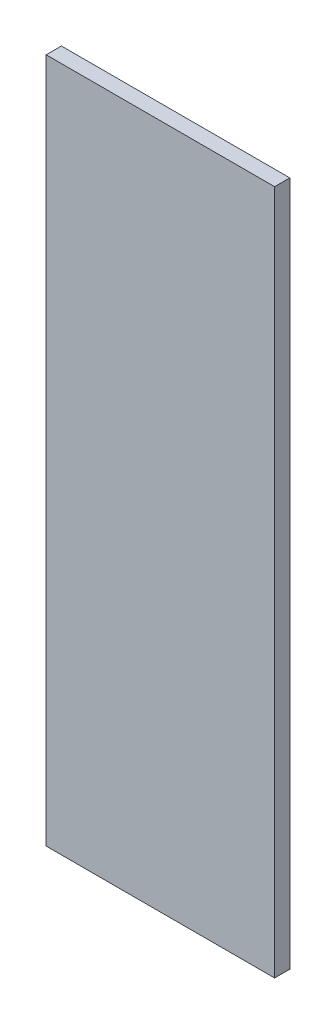
ISO-10303-21;
HEADER;
FILE_DESCRIPTION(('STEP AP214'),'2;1');
FILE_NAME('part.step','',(''),(''),'','','');
FILE_SCHEMA(('AUTOMOTIVE_DESIGN { 1 0 10303 214 1 1 1 1 }'));
ENDSEC;
DATA;
#1=APPLICATION_CONTEXT('core data for automotive mechanical design processes');
#2=APPLICATION_PROTOCOL_DEFINITION('international standard','automotive_design',2000,#1);
#3=PRODUCT_CONTEXT('',#1,'mechanical');
#4=PRODUCT('Part','Part','',(#3));
#5=PRODUCT_RELATED_PRODUCT_CATEGORY('part','',(#4));
#6=PRODUCT_DEFINITION_FORMATION('','',#4);
#7=PRODUCT_DEFINITION_CONTEXT('part definition',#1,'design');
#8=PRODUCT_DEFINITION('design','',#6,#7);
#9=PRODUCT_DEFINITION_SHAPE('','',#8);
#10=(LENGTH_UNIT() NAMED_UNIT(*) SI_UNIT(.MILLI.,.METRE.));
#11=(NAMED_UNIT(*) PLANE_ANGLE_UNIT() SI_UNIT($,.RADIAN.));
#12=(NAMED_UNIT(*) SI_UNIT($,.STERADIAN.) SOLID_ANGLE_UNIT());
#13=UNCERTAINTY_MEASURE_WITH_UNIT(LENGTH_MEASURE(1.E-05),#10,'distance_accuracy_value','');
#14=(GEOMETRIC_REPRESENTATION_CONTEXT(3) GLOBAL_UNCERTAINTY_ASSIGNED_CONTEXT((#13)) GLOBAL_UNIT_ASSIGNED_CONTEXT((#10,
#11,#12)) REPRESENTATION_CONTEXT('',''));
#15=CARTESIAN_POINT('',(0.,0.,0.));
#16=DIRECTION('',(0.,0.,1.));
#17=DIRECTION('',(1.,0.,0.));
#18=AXIS2_PLACEMENT_3D('',#15,#16,#17);
#19=CARTESIAN_POINT('',(-21.50000032037,-8.15,3.5));
#20=DIRECTION('',(0.,0.,1.));
#21=DIRECTION('',(1.,0.,0.));
#22=AXIS2_PLACEMENT_3D('',#19,#20,#21);
#23=PLANE('',#22);
#24=DIRECTION('',(0.,1.,0.));
#25=VECTOR('',#24,1.);
#26=CARTESIAN_POINT('',(-20.00000029802,-12.65,3.5));
#27=LINE('',#26,#25);
#28=CARTESIAN_POINT('',(-20.00000029802,-12.65,3.5));
#29=VERTEX_POINT('',#28);
#30=CARTESIAN_POINT('',(-20.00000029802,-3.65,3.5));
#31=VERTEX_POINT('',#30);
#32=EDGE_CURVE('E79',#29,#31,#27,.T.);
#33=ORIENTED_EDGE('',*,*,#32,.F.);
#34=DIRECTION('',(1.,0.,0.));
#35=VECTOR('',#34,1.);
#36=CARTESIAN_POINT('',(-23.00000034272,-12.65,3.5));
#37=LINE('',#36,#35);
#38=CARTESIAN_POINT('',(-23.00000034272,-12.65,3.5));
#39=VERTEX_POINT('',#38);
#40=EDGE_CURVE('E55',#39,#29,#37,.T.);
#41=ORIENTED_EDGE('',*,*,#40,.F.);
#42=DIRECTION('',(0.,1.,0.));
#43=VECTOR('',#42,1.);
#44=CARTESIAN_POINT('',(-23.00000034272,-3.65,3.5));
#45=LINE('',#44,#43);
#46=CARTESIAN_POINT('',(-23.00000034272,-3.65,3.5));
#47=VERTEX_POINT('',#46);
#48=EDGE_CURVE('E57',#47,#39,#45,.F.);
#49=ORIENTED_EDGE('',*,*,#48,.F.);
#50=DIRECTION('',(1.,0.,0.));
#51=VECTOR('',#50,1.);
#52=CARTESIAN_POINT('',(-20.00000029802,-3.65,3.5));
#53=LINE('',#52,#51);
#54=EDGE_CURVE('E20',#31,#47,#53,.F.);
#55=ORIENTED_EDGE('',*,*,#54,.F.);
#56=EDGE_LOOP('',(#33,#41,#49,#55));
#57=FACE_BOUND('',#56,.T.);
#58=ADVANCED_FACE('F17',(#57),#23,.F.);
#59=CARTESIAN_POINT('',(-20.00000029802,-3.65,3.5));
#60=DIRECTION('',(0.,1.,0.));
#61=DIRECTION('',(0.,0.,1.));
#62=AXIS2_PLACEMENT_3D('',#59,#60,#61);
#63=PLANE('',#62);
#64=DIRECTION('',(1.,0.,0.));
#65=VECTOR('',#64,1.);
#66=CARTESIAN_POINT('',(-21.50000032037,-3.65,3.7));
#67=LINE('',#66,#65);
#68=CARTESIAN_POINT('',(-20.00000029802,-3.65,3.7));
#69=VERTEX_POINT('',#68);
#70=CARTESIAN_POINT('',(-23.00000034272,-3.65,3.7));
#71=VERTEX_POINT('',#70);
#72=EDGE_CURVE('E83',#69,#71,#67,.F.);
#73=ORIENTED_EDGE('',*,*,#72,.F.);
#74=DIRECTION('',(0.,0.,-1.));
#75=VECTOR('',#74,1.);
#76=CARTESIAN_POINT('',(-20.00000029802,-3.65,3.5));
#77=LINE('',#76,#75);
#78=EDGE_CURVE('E68',#31,#69,#77,.F.);
#79=ORIENTED_EDGE('',*,*,#78,.F.);
#80=ORIENTED_EDGE('',*,*,#54,.T.);
#81=DIRECTION('',(0.,0.,1.));
#82=VECTOR('',#81,1.);
#83=CARTESIAN_POINT('',(-23.00000034272,-3.65,3.5));
#84=LINE('',#83,#82);
#85=EDGE_CURVE('E63',#71,#47,#84,.F.);
#86=ORIENTED_EDGE('',*,*,#85,.F.);
#87=EDGE_LOOP('',(#73,#79,#80,#86));
#88=FACE_BOUND('',#87,.T.);
#89=ADVANCED_FACE('F65',(#88),#63,.T.);
#90=CARTESIAN_POINT('',(-23.00000034272,-3.65,3.5));
#91=DIRECTION('',(-1.,0.,0.));
#92=DIRECTION('',(0.,0.,1.));
#93=AXIS2_PLACEMENT_3D('',#90,#91,#92);
#94=PLANE('',#93);
#95=DIRECTION('',(0.,1.,0.));
#96=VECTOR('',#95,1.);
#97=CARTESIAN_POINT('',(-23.00000034272,-8.15,3.7));
#98=LINE('',#97,#96);
#99=CARTESIAN_POINT('',(-23.00000034272,-12.65,3.7));
#100=VERTEX_POINT('',#99);
#101=EDGE_CURVE('E72',#71,#100,#98,.F.);
#102=ORIENTED_EDGE('',*,*,#101,.F.);
#103=ORIENTED_EDGE('',*,*,#85,.T.);
#104=ORIENTED_EDGE('',*,*,#48,.T.);
#105=DIRECTION('',(0.,0.,-1.));
#106=VECTOR('',#105,1.);
#107=CARTESIAN_POINT('',(-23.00000034272,-12.65,3.5));
#108=LINE('',#107,#106);
#109=EDGE_CURVE('E75',#100,#39,#108,.T.);
#110=ORIENTED_EDGE('',*,*,#109,.F.);
#111=EDGE_LOOP('',(#102,#103,#104,#110));
#112=FACE_BOUND('',#111,.T.);
#113=ADVANCED_FACE('F70',(#112),#94,.T.);
#114=CARTESIAN_POINT('',(-23.00000034272,-12.65,3.5));
#115=DIRECTION('',(0.,-1.,0.));
#116=DIRECTION('',(0.,0.,-1.));
#117=AXIS2_PLACEMENT_3D('',#114,#115,#116);
#118=PLANE('',#117);
#119=DIRECTION('',(1.,0.,0.));
#120=VECTOR('',#119,1.);
#121=CARTESIAN_POINT('',(-21.50000032037,-12.65,3.7));
#122=LINE('',#121,#120);
#123=CARTESIAN_POINT('',(-20.00000029802,-12.65,3.7));
#124=VERTEX_POINT('',#123);
#125=EDGE_CURVE('E26',#100,#124,#122,.T.);
#126=ORIENTED_EDGE('',*,*,#125,.F.);
#127=ORIENTED_EDGE('',*,*,#109,.T.);
#128=ORIENTED_EDGE('',*,*,#40,.T.);
#129=DIRECTION('',(0.,0.,-1.));
#130=VECTOR('',#129,1.);
#131=CARTESIAN_POINT('',(-20.00000029802,-12.65,3.5));
#132=LINE('',#131,#130);
#133=EDGE_CURVE('E35',#124,#29,#132,.T.);
#134=ORIENTED_EDGE('',*,*,#133,.F.);
#135=EDGE_LOOP('',(#126,#127,#128,#134));
#136=FACE_BOUND('',#135,.T.);
#137=ADVANCED_FACE('F89',(#136),#118,.T.);
#138=CARTESIAN_POINT('',(-20.00000029802,-12.65,3.5));
#139=DIRECTION('',(1.,0.,0.));
#140=DIRECTION('',(0.,0.,-1.));
#141=AXIS2_PLACEMENT_3D('',#138,#139,#140);
#142=PLANE('',#141);
#143=DIRECTION('',(0.,1.,0.));
#144=VECTOR('',#143,1.);
#145=CARTESIAN_POINT('',(-20.00000029802,-8.15,3.7));
#146=LINE('',#145,#144);
#147=EDGE_CURVE('E11',#124,#69,#146,.T.);
#148=ORIENTED_EDGE('',*,*,#147,.F.);
#149=ORIENTED_EDGE('',*,*,#133,.T.);
#150=ORIENTED_EDGE('',*,*,#32,.T.);
#151=ORIENTED_EDGE('',*,*,#78,.T.);
#152=EDGE_LOOP('',(#148,#149,#150,#151));
#153=FACE_BOUND('',#152,.T.);
#154=ADVANCED_FACE('F91',(#153),#142,.T.);
#155=CARTESIAN_POINT('',(-21.50000032037,-8.15,3.7));
#156=DIRECTION('',(0.,0.,1.));
#157=DIRECTION('',(1.,0.,0.));
#158=AXIS2_PLACEMENT_3D('',#155,#156,#157);
#159=PLANE('',#158);
#160=ORIENTED_EDGE('',*,*,#125,.T.);
#161=ORIENTED_EDGE('',*,*,#147,.T.);
#162=ORIENTED_EDGE('',*,*,#72,.T.);
#163=ORIENTED_EDGE('',*,*,#101,.T.);
#164=EDGE_LOOP('',(#160,#161,#162,#163));
#165=FACE_BOUND('',#164,.T.);
#166=ADVANCED_FACE('F88',(#165),#159,.T.);
#167=CLOSED_SHELL('',(#58,#89,#113,#137,#154,#166));
#168=MANIFOLD_SOLID_BREP('B1',#167);
#169=ADVANCED_BREP_SHAPE_REPRESENTATION('',(#18,#168),#14);
#170=SHAPE_DEFINITION_REPRESENTATION(#9,#169);
ENDSEC;
END-ISO-10303-21;
